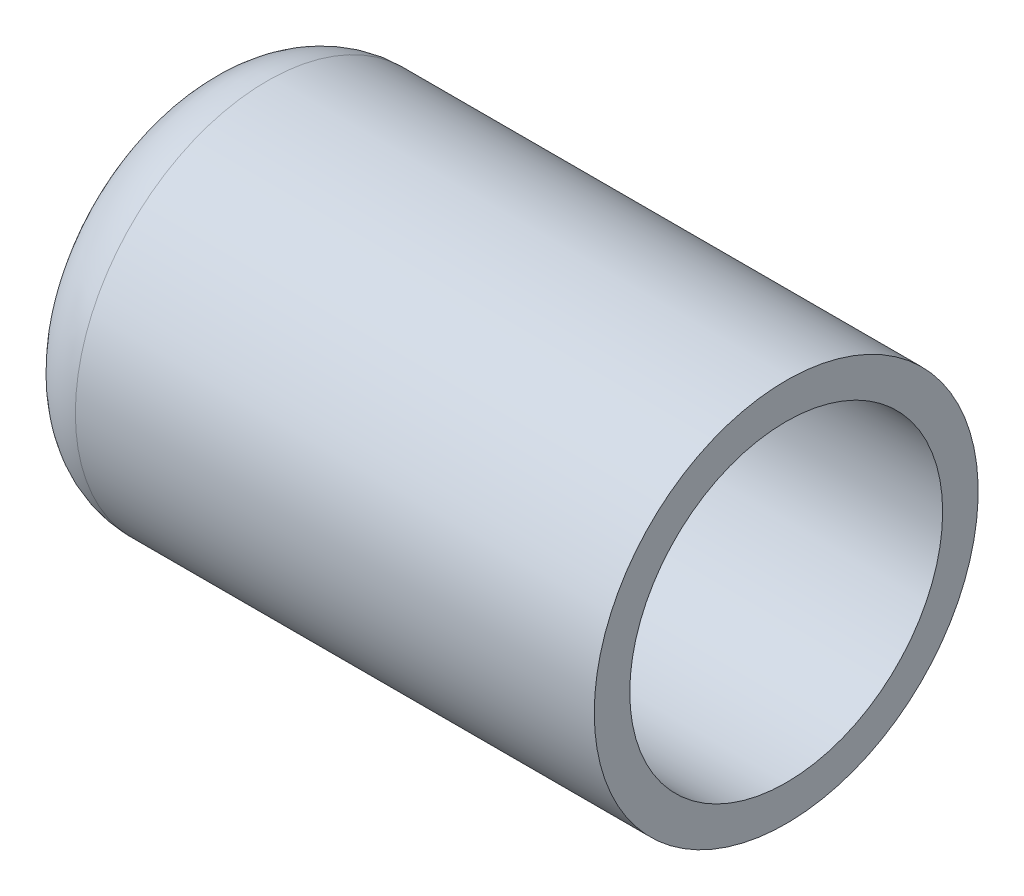
ISO-10303-21;
HEADER;
FILE_DESCRIPTION(('STEP AP214'),'2;1');
FILE_NAME('part.step','',(''),(''),'','','');
FILE_SCHEMA(('AUTOMOTIVE_DESIGN { 1 0 10303 214 1 1 1 1 }'));
ENDSEC;
DATA;
#1=APPLICATION_CONTEXT('core data for automotive mechanical design processes');
#2=APPLICATION_PROTOCOL_DEFINITION('international standard','automotive_design',2000,#1);
#3=PRODUCT_CONTEXT('',#1,'mechanical');
#4=PRODUCT('Part','Part','',(#3));
#5=PRODUCT_RELATED_PRODUCT_CATEGORY('part','',(#4));
#6=PRODUCT_DEFINITION_FORMATION('','',#4);
#7=PRODUCT_DEFINITION_CONTEXT('part definition',#1,'design');
#8=PRODUCT_DEFINITION('design','',#6,#7);
#9=PRODUCT_DEFINITION_SHAPE('','',#8);
#10=(LENGTH_UNIT() NAMED_UNIT(*) SI_UNIT(.MILLI.,.METRE.));
#11=(NAMED_UNIT(*) PLANE_ANGLE_UNIT() SI_UNIT($,.RADIAN.));
#12=(NAMED_UNIT(*) SI_UNIT($,.STERADIAN.) SOLID_ANGLE_UNIT());
#13=UNCERTAINTY_MEASURE_WITH_UNIT(LENGTH_MEASURE(1.E-05),#10,'distance_accuracy_value','');
#14=(GEOMETRIC_REPRESENTATION_CONTEXT(3) GLOBAL_UNCERTAINTY_ASSIGNED_CONTEXT((#13)) GLOBAL_UNIT_ASSIGNED_CONTEXT((#10,
#11,#12)) REPRESENTATION_CONTEXT('',''));
#15=CARTESIAN_POINT('',(0.,0.,0.));
#16=DIRECTION('',(0.,0.,1.));
#17=DIRECTION('',(1.,0.,0.));
#18=AXIS2_PLACEMENT_3D('',#15,#16,#17);
#19=CARTESIAN_POINT('',(-23.9999999999997,0.,0.));
#20=DIRECTION('',(0.,0.,1.));
#21=DIRECTION('',(-1.,0.,0.));
#22=AXIS2_PLACEMENT_3D('',#19,#20,#21);
#23=SPHERICAL_SURFACE('',#22,36.3000000000003);
#24=CARTESIAN_POINT('',(-57.4790588058243,0.,0.));
#25=DIRECTION('',(-1.,0.,0.));
#26=DIRECTION('',(0.,0.,1.));
#27=AXIS2_PLACEMENT_3D('',#24,#25,#26);
#28=CIRCLE('',#27,14.0300613496933);
#29=CARTESIAN_POINT('',(-57.4790588058243,0.,14.0300613496933));
#30=VERTEX_POINT('',#29);
#31=EDGE_CURVE('E17',#30,#30,#28,.T.);
#32=ORIENTED_EDGE('',*,*,#31,.F.);
#33=EDGE_LOOP('',(#32));
#34=FACE_BOUND('',#33,.T.);
#35=ADVANCED_FACE('F13',(#34),#23,.F.);
#36=CARTESIAN_POINT('',(-54.0665927567458,0.,0.));
#37=DIRECTION('',(-1.,0.,0.));
#38=DIRECTION('',(0.,0.,1.));
#39=AXIS2_PLACEMENT_3D('',#36,#37,#38);
#40=TOROIDAL_SURFACE('',#39,12.6,3.70000000000004);
#41=CARTESIAN_POINT('',(-54.0665927567458,0.,0.));
#42=DIRECTION('',(-1.,0.,0.));
#43=DIRECTION('',(0.,1.,0.));
#44=AXIS2_PLACEMENT_3D('',#41,#42,#43);
#45=CIRCLE('',#44,16.3);
#46=CARTESIAN_POINT('',(-54.0665927567458,16.3,0.));
#47=VERTEX_POINT('',#46);
#48=EDGE_CURVE('E34',#47,#47,#45,.T.);
#49=ORIENTED_EDGE('',*,*,#48,.F.);
#50=EDGE_LOOP('',(#49));
#51=FACE_BOUND('',#50,.T.);
#52=ORIENTED_EDGE('',*,*,#31,.T.);
#53=EDGE_LOOP('',(#52));
#54=FACE_BOUND('',#53,.T.);
#55=ADVANCED_FACE('F44',(#51,#54),#40,.F.);
#56=CARTESIAN_POINT('',(0.,0.,0.));
#57=DIRECTION('',(-1.,0.,0.));
#58=DIRECTION('',(0.,0.,1.));
#59=AXIS2_PLACEMENT_3D('',#56,#57,#58);
#60=CYLINDRICAL_SURFACE('',#59,16.3);
#61=CARTESIAN_POINT('',(0.,0.,0.));
#62=DIRECTION('',(-1.,0.,0.));
#63=DIRECTION('',(0.,0.,1.));
#64=AXIS2_PLACEMENT_3D('',#61,#62,#63);
#65=CIRCLE('',#64,16.3);
#66=CARTESIAN_POINT('',(0.,0.,16.3));
#67=VERTEX_POINT('',#66);
#68=EDGE_CURVE('E32',#67,#67,#65,.T.);
#69=ORIENTED_EDGE('',*,*,#68,.F.);
#70=EDGE_LOOP('',(#69));
#71=FACE_BOUND('',#70,.T.);
#72=ORIENTED_EDGE('',*,*,#48,.T.);
#73=EDGE_LOOP('',(#72));
#74=FACE_BOUND('',#73,.T.);
#75=ADVANCED_FACE('F47',(#71,#74),#60,.F.);
#76=CARTESIAN_POINT('',(0.,20.,20.2400021083974));
#77=DIRECTION('',(1.,0.,0.));
#78=DIRECTION('',(0.,-1.,0.));
#79=AXIS2_PLACEMENT_3D('',#76,#77,#78);
#80=PLANE('',#79);
#81=ORIENTED_EDGE('',*,*,#68,.T.);
#82=EDGE_LOOP('',(#81));
#83=FACE_BOUND('',#82,.T.);
#84=CARTESIAN_POINT('',(0.,0.,0.));
#85=DIRECTION('',(-1.,0.,0.));
#86=DIRECTION('',(0.,0.,1.));
#87=AXIS2_PLACEMENT_3D('',#84,#85,#86);
#88=CIRCLE('',#87,20.);
#89=CARTESIAN_POINT('',(0.,0.,20.));
#90=VERTEX_POINT('',#89);
#91=EDGE_CURVE('E26',#90,#90,#88,.T.);
#92=ORIENTED_EDGE('',*,*,#91,.F.);
#93=EDGE_LOOP('',(#92));
#94=FACE_BOUND('',#93,.T.);
#95=ADVANCED_FACE('F51',(#83,#94),#80,.T.);
#96=CARTESIAN_POINT('',(-54.0665927567458,0.,0.));
#97=DIRECTION('',(-1.,0.,0.));
#98=DIRECTION('',(0.,0.,1.));
#99=AXIS2_PLACEMENT_3D('',#96,#97,#98);
#100=CYLINDRICAL_SURFACE('',#99,20.);
#101=ORIENTED_EDGE('',*,*,#91,.T.);
#102=EDGE_LOOP('',(#101));
#103=FACE_BOUND('',#102,.T.);
#104=CARTESIAN_POINT('',(-54.0665927567458,0.,0.));
#105=DIRECTION('',(-1.,0.,0.));
#106=DIRECTION('',(0.,0.,1.));
#107=AXIS2_PLACEMENT_3D('',#104,#105,#106);
#108=CIRCLE('',#107,20.);
#109=CARTESIAN_POINT('',(-54.0665927567458,0.,20.));
#110=VERTEX_POINT('',#109);
#111=EDGE_CURVE('E21',#110,#110,#108,.T.);
#112=ORIENTED_EDGE('',*,*,#111,.F.);
#113=EDGE_LOOP('',(#112));
#114=FACE_BOUND('',#113,.T.);
#115=ADVANCED_FACE('F55',(#103,#114),#100,.T.);
#116=CARTESIAN_POINT('',(-54.0665927567458,0.,0.));
#117=DIRECTION('',(-1.,0.,0.));
#118=DIRECTION('',(0.,0.,1.));
#119=AXIS2_PLACEMENT_3D('',#116,#117,#118);
#120=TOROIDAL_SURFACE('',#119,12.6,7.39999999999999);
#121=ORIENTED_EDGE('',*,*,#111,.T.);
#122=EDGE_LOOP('',(#121));
#123=FACE_BOUND('',#122,.T.);
#124=CARTESIAN_POINT('',(-60.8915248549028,0.,0.));
#125=DIRECTION('',(-1.,0.,0.));
#126=DIRECTION('',(0.,0.,1.));
#127=AXIS2_PLACEMENT_3D('',#124,#125,#126);
#128=CIRCLE('',#127,15.4601226993865);
#129=CARTESIAN_POINT('',(-60.8915248549028,0.,15.4601226993865));
#130=VERTEX_POINT('',#129);
#131=EDGE_CURVE('E8',#130,#130,#128,.T.);
#132=ORIENTED_EDGE('',*,*,#131,.F.);
#133=EDGE_LOOP('',(#132));
#134=FACE_BOUND('',#133,.T.);
#135=ADVANCED_FACE('F58',(#123,#134),#120,.T.);
#136=CARTESIAN_POINT('',(-23.9999999999997,0.,0.));
#137=DIRECTION('',(0.,0.,1.));
#138=DIRECTION('',(1.,0.,0.));
#139=AXIS2_PLACEMENT_3D('',#136,#137,#138);
#140=SPHERICAL_SURFACE('',#139,40.0000000000003);
#141=ORIENTED_EDGE('',*,*,#131,.T.);
#142=EDGE_LOOP('',(#141));
#143=FACE_BOUND('',#142,.T.);
#144=ADVANCED_FACE('F62',(#143),#140,.T.);
#145=CLOSED_SHELL('',(#35,#55,#75,#95,#115,#135,#144));
#146=MANIFOLD_SOLID_BREP('B1',#145);
#147=ADVANCED_BREP_SHAPE_REPRESENTATION('',(#18,#146),#14);
#148=SHAPE_DEFINITION_REPRESENTATION(#9,#147);
ENDSEC;
END-ISO-10303-21;
